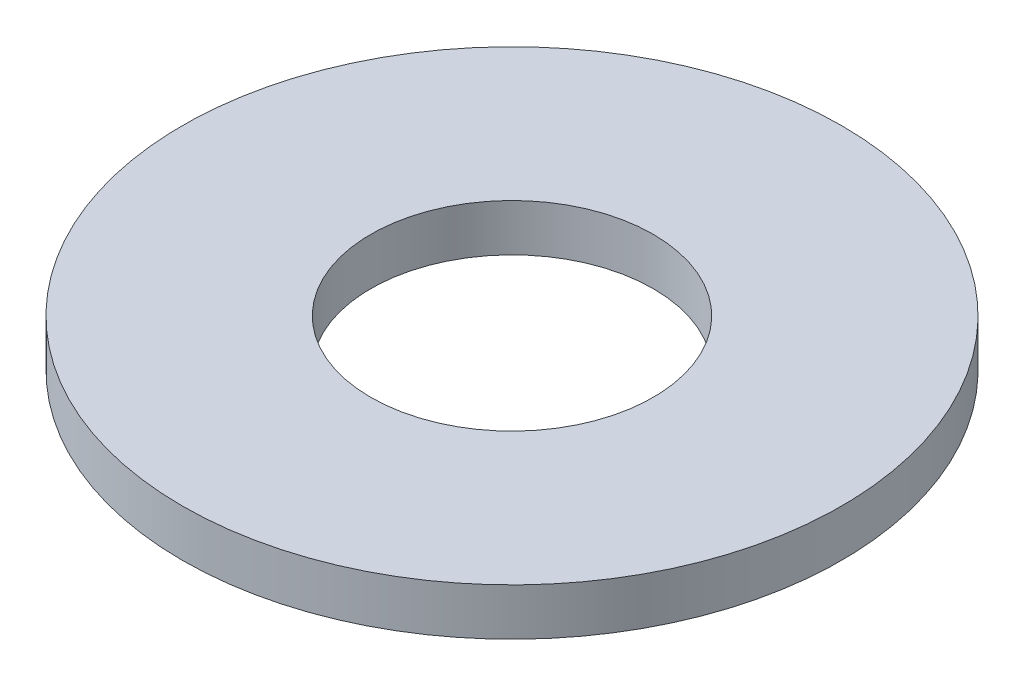
ISO-10303-21;
HEADER;
FILE_DESCRIPTION(('STEP AP214'),'2;1');
FILE_NAME('part.step','',(''),(''),'','','');
FILE_SCHEMA(('AUTOMOTIVE_DESIGN { 1 0 10303 214 1 1 1 1 }'));
ENDSEC;
DATA;
#1=APPLICATION_CONTEXT('core data for automotive mechanical design processes');
#2=APPLICATION_PROTOCOL_DEFINITION('international standard','automotive_design',2000,#1);
#3=PRODUCT_CONTEXT('',#1,'mechanical');
#4=PRODUCT('Part','Part','',(#3));
#5=PRODUCT_RELATED_PRODUCT_CATEGORY('part','',(#4));
#6=PRODUCT_DEFINITION_FORMATION('','',#4);
#7=PRODUCT_DEFINITION_CONTEXT('part definition',#1,'design');
#8=PRODUCT_DEFINITION('design','',#6,#7);
#9=PRODUCT_DEFINITION_SHAPE('','',#8);
#10=(LENGTH_UNIT() NAMED_UNIT(*) SI_UNIT(.MILLI.,.METRE.));
#11=(NAMED_UNIT(*) PLANE_ANGLE_UNIT() SI_UNIT($,.RADIAN.));
#12=(NAMED_UNIT(*) SI_UNIT($,.STERADIAN.) SOLID_ANGLE_UNIT());
#13=UNCERTAINTY_MEASURE_WITH_UNIT(LENGTH_MEASURE(1.E-05),#10,'distance_accuracy_value','');
#14=(GEOMETRIC_REPRESENTATION_CONTEXT(3) GLOBAL_UNCERTAINTY_ASSIGNED_CONTEXT((#13)) GLOBAL_UNIT_ASSIGNED_CONTEXT((#10,
#11,#12)) REPRESENTATION_CONTEXT('',''));
#15=CARTESIAN_POINT('',(0.,0.,0.));
#16=DIRECTION('',(0.,0.,1.));
#17=DIRECTION('',(1.,0.,0.));
#18=AXIS2_PLACEMENT_3D('',#15,#16,#17);
#19=CARTESIAN_POINT('',(0.,0.5,0.));
#20=DIRECTION('',(0.,1.,0.));
#21=DIRECTION('',(0.,0.,1.));
#22=AXIS2_PLACEMENT_3D('',#19,#20,#21);
#23=PLANE('',#22);
#24=CARTESIAN_POINT('',(0.,0.5,0.));
#25=DIRECTION('',(0.,1.,0.));
#26=DIRECTION('',(0.,0.,1.));
#27=AXIS2_PLACEMENT_3D('',#24,#25,#26);
#28=CIRCLE('',#27,3.5);
#29=CARTESIAN_POINT('',(0.,0.5,3.5));
#30=VERTEX_POINT('',#29);
#31=EDGE_CURVE('E10',#30,#30,#28,.T.);
#32=ORIENTED_EDGE('',*,*,#31,.T.);
#33=EDGE_LOOP('',(#32));
#34=FACE_BOUND('',#33,.T.);
#35=CARTESIAN_POINT('',(0.,0.5,0.));
#36=DIRECTION('',(0.,1.,0.));
#37=DIRECTION('',(0.,0.,1.));
#38=AXIS2_PLACEMENT_3D('',#35,#36,#37);
#39=CIRCLE('',#38,1.5);
#40=CARTESIAN_POINT('',(0.,0.5,1.5));
#41=VERTEX_POINT('',#40);
#42=EDGE_CURVE('E44',#41,#41,#39,.T.);
#43=ORIENTED_EDGE('',*,*,#42,.F.);
#44=EDGE_LOOP('',(#43));
#45=FACE_BOUND('',#44,.T.);
#46=ADVANCED_FACE('F33',(#34,#45),#23,.T.);
#47=CARTESIAN_POINT('',(0.,0.,0.));
#48=DIRECTION('',(0.,1.,0.));
#49=DIRECTION('',(0.,0.,1.));
#50=AXIS2_PLACEMENT_3D('',#47,#48,#49);
#51=PLANE('',#50);
#52=CARTESIAN_POINT('',(0.,0.,0.));
#53=DIRECTION('',(0.,1.,0.));
#54=DIRECTION('',(0.,0.,1.));
#55=AXIS2_PLACEMENT_3D('',#52,#53,#54);
#56=CIRCLE('',#55,3.5);
#57=CARTESIAN_POINT('',(0.,0.,3.5));
#58=VERTEX_POINT('',#57);
#59=EDGE_CURVE('E37',#58,#58,#56,.T.);
#60=ORIENTED_EDGE('',*,*,#59,.F.);
#61=EDGE_LOOP('',(#60));
#62=FACE_BOUND('',#61,.T.);
#63=CARTESIAN_POINT('',(0.,0.,0.));
#64=DIRECTION('',(0.,1.,0.));
#65=DIRECTION('',(0.,0.,1.));
#66=AXIS2_PLACEMENT_3D('',#63,#64,#65);
#67=CIRCLE('',#66,1.5);
#68=CARTESIAN_POINT('',(0.,0.,1.5));
#69=VERTEX_POINT('',#68);
#70=EDGE_CURVE('E46',#69,#69,#67,.T.);
#71=ORIENTED_EDGE('',*,*,#70,.T.);
#72=EDGE_LOOP('',(#71));
#73=FACE_BOUND('',#72,.T.);
#74=ADVANCED_FACE('F56',(#62,#73),#51,.F.);
#75=CARTESIAN_POINT('',(0.,0.5,0.));
#76=DIRECTION('',(0.,-1.,0.));
#77=DIRECTION('',(0.,0.,-1.));
#78=AXIS2_PLACEMENT_3D('',#75,#76,#77);
#79=CYLINDRICAL_SURFACE('',#78,3.5);
#80=ORIENTED_EDGE('',*,*,#31,.F.);
#81=EDGE_LOOP('',(#80));
#82=FACE_BOUND('',#81,.T.);
#83=ORIENTED_EDGE('',*,*,#59,.T.);
#84=EDGE_LOOP('',(#83));
#85=FACE_BOUND('',#84,.T.);
#86=ADVANCED_FACE('F35',(#82,#85),#79,.T.);
#87=CARTESIAN_POINT('',(0.,0.5,0.));
#88=DIRECTION('',(0.,-1.,0.));
#89=DIRECTION('',(0.,0.,-1.));
#90=AXIS2_PLACEMENT_3D('',#87,#88,#89);
#91=CYLINDRICAL_SURFACE('',#90,1.5);
#92=ORIENTED_EDGE('',*,*,#42,.T.);
#93=EDGE_LOOP('',(#92));
#94=FACE_BOUND('',#93,.T.);
#95=ORIENTED_EDGE('',*,*,#70,.F.);
#96=EDGE_LOOP('',(#95));
#97=FACE_BOUND('',#96,.T.);
#98=ADVANCED_FACE('F52',(#94,#97),#91,.F.);
#99=CLOSED_SHELL('',(#46,#74,#86,#98));
#100=MANIFOLD_SOLID_BREP('B2',#99);
#101=ADVANCED_BREP_SHAPE_REPRESENTATION('',(#18,#100),#14);
#102=SHAPE_DEFINITION_REPRESENTATION(#9,#101);
ENDSEC;
END-ISO-10303-21;
